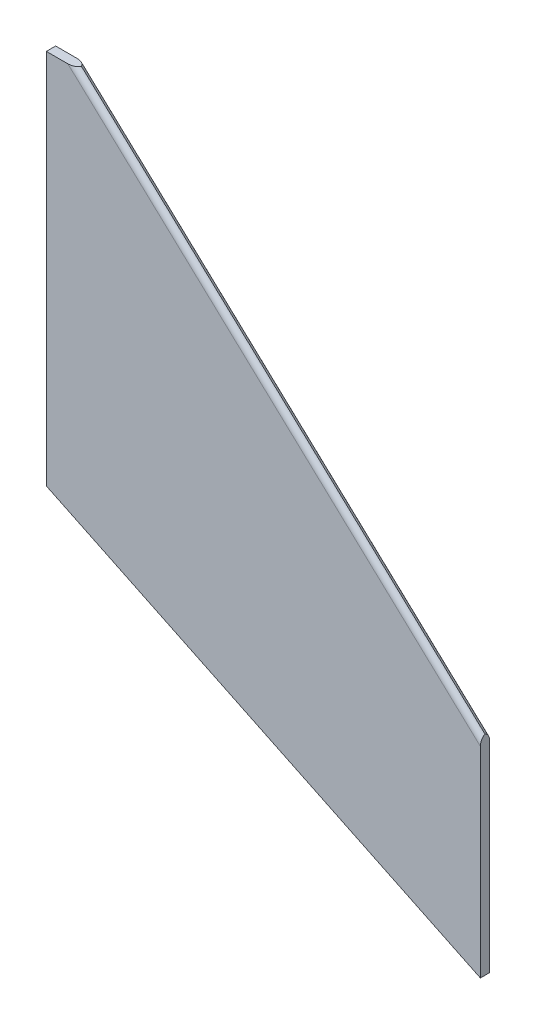
ISO-10303-21;
HEADER;
FILE_DESCRIPTION(('STEP AP214'),'2;1');
FILE_NAME('part.step','',(''),(''),'','','');
FILE_SCHEMA(('AUTOMOTIVE_DESIGN { 1 0 10303 214 1 1 1 1 }'));
ENDSEC;
DATA;
#1=APPLICATION_CONTEXT('core data for automotive mechanical design processes');
#2=APPLICATION_PROTOCOL_DEFINITION('international standard','automotive_design',2000,#1);
#3=PRODUCT_CONTEXT('',#1,'mechanical');
#4=PRODUCT('Part','Part','',(#3));
#5=PRODUCT_RELATED_PRODUCT_CATEGORY('part','',(#4));
#6=PRODUCT_DEFINITION_FORMATION('','',#4);
#7=PRODUCT_DEFINITION_CONTEXT('part definition',#1,'design');
#8=PRODUCT_DEFINITION('design','',#6,#7);
#9=PRODUCT_DEFINITION_SHAPE('','',#8);
#10=(LENGTH_UNIT() NAMED_UNIT(*) SI_UNIT(.MILLI.,.METRE.));
#11=(NAMED_UNIT(*) PLANE_ANGLE_UNIT() SI_UNIT($,.RADIAN.));
#12=(NAMED_UNIT(*) SI_UNIT($,.STERADIAN.) SOLID_ANGLE_UNIT());
#13=UNCERTAINTY_MEASURE_WITH_UNIT(LENGTH_MEASURE(1.E-05),#10,'distance_accuracy_value','');
#14=(GEOMETRIC_REPRESENTATION_CONTEXT(3) GLOBAL_UNCERTAINTY_ASSIGNED_CONTEXT((#13)) GLOBAL_UNIT_ASSIGNED_CONTEXT((#10,
#11,#12)) REPRESENTATION_CONTEXT('',''));
#15=CARTESIAN_POINT('',(0.,0.,0.));
#16=DIRECTION('',(0.,0.,1.));
#17=DIRECTION('',(1.,0.,0.));
#18=AXIS2_PLACEMENT_3D('',#15,#16,#17);
#19=CARTESIAN_POINT('',(-24.1651173674846,-826.289827771481,3.81));
#20=DIRECTION('',(0.,-1.,0.));
#21=DIRECTION('',(0.,0.,-1.));
#22=AXIS2_PLACEMENT_3D('',#19,#20,#21);
#23=PLANE('',#22);
#24=DIRECTION('',(-1.,0.,0.));
#25=VECTOR('',#24,1.);
#26=CARTESIAN_POINT('',(-24.1651173674846,-826.289827771481,3.81));
#27=LINE('',#26,#25);
#28=CARTESIAN_POINT('',(-27.8888128215821,-826.289827771481,3.81));
#29=VERTEX_POINT('',#28);
#30=CARTESIAN_POINT('',(-36.6948360722391,-826.289827771481,3.81));
#31=VERTEX_POINT('',#30);
#32=EDGE_CURVE('E88',#29,#31,#27,.T.);
#33=ORIENTED_EDGE('',*,*,#32,.F.);
#34=CARTESIAN_POINT('',(-27.8888128215821,-826.289827771481,1.27));
#35=DIRECTION('',(0.,-1.,0.));
#36=DIRECTION('',(-1.,0.,0.));
#37=AXIS2_PLACEMENT_3D('',#34,#35,#36);
#38=ELLIPSE('',#37,3.72369545409741,2.54);
#39=CARTESIAN_POINT('',(-24.2833602015652,-826.289827771481,1.90499999999986));
#40=VERTEX_POINT('',#39);
#41=EDGE_CURVE('E119',#29,#40,#38,.F.);
#42=ORIENTED_EDGE('',*,*,#41,.T.);
#43=CARTESIAN_POINT('',(-27.888812821582,-826.289827771481,2.54));
#44=DIRECTION('',(0.,-1.,0.));
#45=DIRECTION('',(1.,0.,0.));
#46=AXIS2_PLACEMENT_3D('',#43,#44,#45);
#47=ELLIPSE('',#46,3.72369545409741,2.54);
#48=CARTESIAN_POINT('',(-27.888812821582,-826.289827771481,0.));
#49=VERTEX_POINT('',#48);
#50=EDGE_CURVE('E112',#40,#49,#47,.F.);
#51=ORIENTED_EDGE('',*,*,#50,.T.);
#52=DIRECTION('',(-1.,0.,0.));
#53=VECTOR('',#52,1.);
#54=CARTESIAN_POINT('',(-24.1651173674846,-826.289827771481,0.));
#55=LINE('',#54,#53);
#56=CARTESIAN_POINT('',(-36.6948360722391,-826.289827771481,0.));
#57=VERTEX_POINT('',#56);
#58=EDGE_CURVE('E109',#49,#57,#55,.T.);
#59=ORIENTED_EDGE('',*,*,#58,.T.);
#60=DIRECTION('',(0.,0.,-1.));
#61=VECTOR('',#60,1.);
#62=CARTESIAN_POINT('',(-36.6948360722391,-826.289827771481,3.81));
#63=LINE('',#62,#61);
#64=EDGE_CURVE('E103',#31,#57,#63,.T.);
#65=ORIENTED_EDGE('',*,*,#64,.F.);
#66=EDGE_LOOP('',(#33,#42,#51,#59,#65));
#67=FACE_BOUND('',#66,.T.);
#68=ADVANCED_FACE('F34',(#67),#23,.F.);
#69=CARTESIAN_POINT('',(-36.6948360722391,-980.294891712837,3.81));
#70=DIRECTION('',(1.,0.,0.));
#71=DIRECTION('',(0.,0.,-1.));
#72=AXIS2_PLACEMENT_3D('',#69,#70,#71);
#73=PLANE('',#72);
#74=DIRECTION('',(0.,-1.,0.));
#75=VECTOR('',#74,1.);
#76=CARTESIAN_POINT('',(-36.6948360722391,-980.294891712837,0.));
#77=LINE('',#76,#75);
#78=CARTESIAN_POINT('',(-36.6948360722391,-980.294891712837,0.));
#79=VERTEX_POINT('',#78);
#80=EDGE_CURVE('E134',#57,#79,#77,.T.);
#81=ORIENTED_EDGE('',*,*,#80,.T.);
#82=DIRECTION('',(0.,0.,-1.));
#83=VECTOR('',#82,1.);
#84=CARTESIAN_POINT('',(-36.6948360722391,-980.294891712837,3.81));
#85=LINE('',#84,#83);
#86=CARTESIAN_POINT('',(-36.6948360722391,-980.294891712837,3.81));
#87=VERTEX_POINT('',#86);
#88=EDGE_CURVE('E105',#87,#79,#85,.T.);
#89=ORIENTED_EDGE('',*,*,#88,.F.);
#90=DIRECTION('',(0.,-1.,0.));
#91=VECTOR('',#90,1.);
#92=CARTESIAN_POINT('',(-36.6948360722391,-980.294891712837,3.81));
#93=LINE('',#92,#91);
#94=EDGE_CURVE('E92',#31,#87,#93,.T.);
#95=ORIENTED_EDGE('',*,*,#94,.F.);
#96=ORIENTED_EDGE('',*,*,#64,.T.);
#97=EDGE_LOOP('',(#81,#89,#95,#96));
#98=FACE_BOUND('',#97,.T.);
#99=ADVANCED_FACE('F102',(#98),#73,.F.);
#100=CARTESIAN_POINT('',(140.930897985916,-1065.87027441784,3.81));
#101=DIRECTION('',(0.434029221049681,0.900898793025613,0.));
#102=DIRECTION('',(-0.900898793025614,0.434029221049681,0.));
#103=AXIS2_PLACEMENT_3D('',#100,#101,#102);
#104=PLANE('',#103);
#105=DIRECTION('',(0.900898793025614,-0.434029221049681,0.));
#106=VECTOR('',#105,1.);
#107=CARTESIAN_POINT('',(140.930897985916,-1065.87027441784,0.));
#108=LINE('',#107,#106);
#109=CARTESIAN_POINT('',(140.930897985916,-1065.87027441784,0.));
#110=VERTEX_POINT('',#109);
#111=EDGE_CURVE('E136',#79,#110,#108,.T.);
#112=ORIENTED_EDGE('',*,*,#111,.T.);
#113=DIRECTION('',(0.,0.,-1.));
#114=VECTOR('',#113,1.);
#115=CARTESIAN_POINT('',(140.930897985916,-1065.87027441784,3.81));
#116=LINE('',#115,#114);
#117=CARTESIAN_POINT('',(140.930897985916,-1065.87027441784,3.81));
#118=VERTEX_POINT('',#117);
#119=EDGE_CURVE('E114',#118,#110,#116,.T.);
#120=ORIENTED_EDGE('',*,*,#119,.F.);
#121=DIRECTION('',(0.900898793025614,-0.434029221049681,0.));
#122=VECTOR('',#121,1.);
#123=CARTESIAN_POINT('',(140.930897985916,-1065.87027441784,3.81));
#124=LINE('',#123,#122);
#125=EDGE_CURVE('E107',#87,#118,#124,.T.);
#126=ORIENTED_EDGE('',*,*,#125,.F.);
#127=ORIENTED_EDGE('',*,*,#88,.T.);
#128=EDGE_LOOP('',(#112,#120,#126,#127));
#129=FACE_BOUND('',#128,.T.);
#130=ADVANCED_FACE('F144',(#129),#104,.F.);
#131=CARTESIAN_POINT('',(140.930897985916,-980.294891712837,3.81));
#132=DIRECTION('',(-1.,0.,0.));
#133=DIRECTION('',(0.,0.,1.));
#134=AXIS2_PLACEMENT_3D('',#131,#132,#133);
#135=PLANE('',#134);
#136=CARTESIAN_POINT('',(140.930897985916,-983.768433792449,2.54));
#137=DIRECTION('',(-1.,0.,0.));
#138=DIRECTION('',(0.,-1.,0.));
#139=AXIS2_PLACEMENT_3D('',#136,#137,#138);
#140=ELLIPSE('',#139,3.47354207961262,2.54);
#141=CARTESIAN_POINT('',(140.930897985916,-983.768433792449,0.));
#142=VERTEX_POINT('',#141);
#143=CARTESIAN_POINT('',(140.930897985916,-980.405191135777,1.90499999999984));
#144=VERTEX_POINT('',#143);
#145=EDGE_CURVE('E50',#142,#144,#140,.F.);
#146=ORIENTED_EDGE('',*,*,#145,.T.);
#147=CARTESIAN_POINT('',(140.930897985916,-983.76843379245,1.27));
#148=DIRECTION('',(-1.,0.,0.));
#149=DIRECTION('',(0.,1.,0.));
#150=AXIS2_PLACEMENT_3D('',#147,#148,#149);
#151=ELLIPSE('',#150,3.47354207961262,2.54);
#152=CARTESIAN_POINT('',(140.930897985916,-983.76843379245,3.81));
#153=VERTEX_POINT('',#152);
#154=EDGE_CURVE('E43',#144,#153,#151,.F.);
#155=ORIENTED_EDGE('',*,*,#154,.T.);
#156=DIRECTION('',(0.,1.,0.));
#157=VECTOR('',#156,1.);
#158=CARTESIAN_POINT('',(140.930897985916,-980.294891712837,3.81));
#159=LINE('',#158,#157);
#160=EDGE_CURVE('E126',#118,#153,#159,.T.);
#161=ORIENTED_EDGE('',*,*,#160,.F.);
#162=ORIENTED_EDGE('',*,*,#119,.T.);
#163=DIRECTION('',(0.,1.,0.));
#164=VECTOR('',#163,1.);
#165=CARTESIAN_POINT('',(140.930897985916,-980.294891712837,0.));
#166=LINE('',#165,#164);
#167=EDGE_CURVE('E98',#110,#142,#166,.T.);
#168=ORIENTED_EDGE('',*,*,#167,.T.);
#169=EDGE_LOOP('',(#146,#155,#161,#162,#168));
#170=FACE_BOUND('',#169,.T.);
#171=ADVANCED_FACE('F124',(#170),#135,.F.);
#172=CARTESIAN_POINT('',(0.,0.,3.81));
#173=DIRECTION('',(0.,0.,-1.));
#174=DIRECTION('',(-1.,0.,0.));
#175=AXIS2_PLACEMENT_3D('',#172,#173,#174);
#176=PLANE('',#175);
#177=ORIENTED_EDGE('',*,*,#160,.T.);
#178=DIRECTION('',(-0.731242041058927,0.682118081704315,0.));
#179=VECTOR('',#178,1.);
#180=CARTESIAN_POINT('',(-425.124176139762,-455.740257591779,3.81));
#181=LINE('',#180,#179);
#182=EDGE_CURVE('E95',#153,#29,#181,.T.);
#183=ORIENTED_EDGE('',*,*,#182,.T.);
#184=ORIENTED_EDGE('',*,*,#32,.T.);
#185=ORIENTED_EDGE('',*,*,#94,.T.);
#186=ORIENTED_EDGE('',*,*,#125,.T.);
#187=EDGE_LOOP('',(#177,#183,#184,#185,#186));
#188=FACE_BOUND('',#187,.T.);
#189=ADVANCED_FACE('F91',(#188),#176,.F.);
#190=CARTESIAN_POINT('',(0.,0.,0.));
#191=DIRECTION('',(0.,0.,-1.));
#192=DIRECTION('',(-1.,0.,0.));
#193=AXIS2_PLACEMENT_3D('',#190,#191,#192);
#194=PLANE('',#193);
#195=ORIENTED_EDGE('',*,*,#58,.F.);
#196=DIRECTION('',(-0.731242041058927,0.682118081704315,0.));
#197=VECTOR('',#196,1.);
#198=CARTESIAN_POINT('',(139.198318058387,-982.152246497126,0.));
#199=LINE('',#198,#197);
#200=EDGE_CURVE('E11',#49,#142,#199,.F.);
#201=ORIENTED_EDGE('',*,*,#200,.T.);
#202=ORIENTED_EDGE('',*,*,#167,.F.);
#203=ORIENTED_EDGE('',*,*,#111,.F.);
#204=ORIENTED_EDGE('',*,*,#80,.F.);
#205=EDGE_LOOP('',(#195,#201,#202,#203,#204));
#206=FACE_BOUND('',#205,.T.);
#207=ADVANCED_FACE('F143',(#206),#194,.T.);
#208=CARTESIAN_POINT('',(-25.8976972950135,-828.147182555771,2.54));
#209=DIRECTION('',(0.731242041058927,-0.682118081704315,0.));
#210=DIRECTION('',(0.682118081704315,0.731242041058927,0.));
#211=AXIS2_PLACEMENT_3D('',#208,#209,#210);
#212=CYLINDRICAL_SURFACE('',#211,2.54);
#213=DIRECTION('',(0.731242041058927,-0.682118081704315,0.));
#214=VECTOR('',#213,1.);
#215=CARTESIAN_POINT('',(58.1986058834901,-903.230754745077,1.90499999999981));
#216=LINE('',#215,#214);
#217=EDGE_CURVE('E38',#144,#40,#216,.F.);
#218=ORIENTED_EDGE('',*,*,#217,.F.);
#219=ORIENTED_EDGE('',*,*,#145,.F.);
#220=ORIENTED_EDGE('',*,*,#200,.F.);
#221=ORIENTED_EDGE('',*,*,#50,.F.);
#222=EDGE_LOOP('',(#218,#219,#220,#221));
#223=FACE_BOUND('',#222,.T.);
#224=ADVANCED_FACE('F36',(#223),#212,.T.);
#225=CARTESIAN_POINT('',(-425.124176139762,-455.740257591779,1.27));
#226=DIRECTION('',(-0.731242041058927,0.682118081704315,0.));
#227=DIRECTION('',(-0.682118081704315,-0.731242041058927,0.));
#228=AXIS2_PLACEMENT_3D('',#225,#226,#227);
#229=CYLINDRICAL_SURFACE('',#228,2.54);
#230=ORIENTED_EDGE('',*,*,#154,.F.);
#231=ORIENTED_EDGE('',*,*,#217,.T.);
#232=ORIENTED_EDGE('',*,*,#41,.F.);
#233=ORIENTED_EDGE('',*,*,#182,.F.);
#234=EDGE_LOOP('',(#230,#231,#232,#233));
#235=FACE_BOUND('',#234,.T.);
#236=ADVANCED_FACE('F131',(#235),#229,.T.);
#237=CLOSED_SHELL('',(#68,#99,#130,#171,#189,#207,#224,#236));
#238=MANIFOLD_SOLID_BREP('B2',#237);
#239=ADVANCED_BREP_SHAPE_REPRESENTATION('',(#18,#238),#14);
#240=SHAPE_DEFINITION_REPRESENTATION(#9,#239);
ENDSEC;
END-ISO-10303-21;
